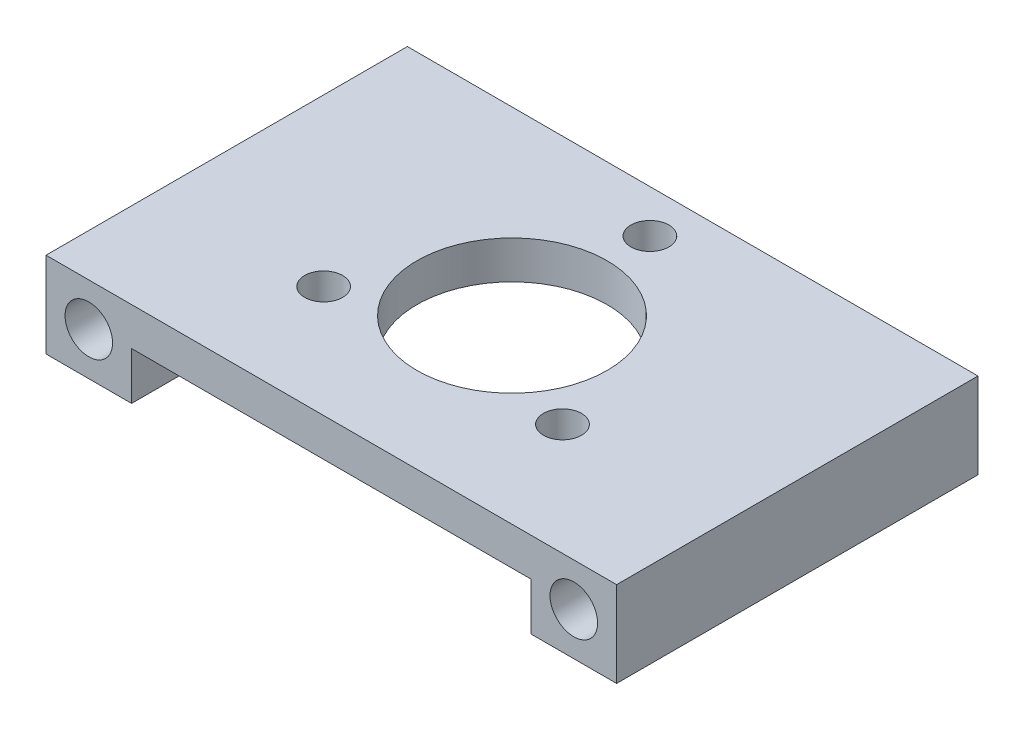
ISO-10303-21;
HEADER;
FILE_DESCRIPTION(('STEP AP214'),'2;1');
FILE_NAME('part.step','',(''),(''),'','','');
FILE_SCHEMA(('AUTOMOTIVE_DESIGN { 1 0 10303 214 1 1 1 1 }'));
ENDSEC;
DATA;
#1=APPLICATION_CONTEXT('core data for automotive mechanical design processes');
#2=APPLICATION_PROTOCOL_DEFINITION('international standard','automotive_design',2000,#1);
#3=PRODUCT_CONTEXT('',#1,'mechanical');
#4=PRODUCT('Part','Part','',(#3));
#5=PRODUCT_RELATED_PRODUCT_CATEGORY('part','',(#4));
#6=PRODUCT_DEFINITION_FORMATION('','',#4);
#7=PRODUCT_DEFINITION_CONTEXT('part definition',#1,'design');
#8=PRODUCT_DEFINITION('design','',#6,#7);
#9=PRODUCT_DEFINITION_SHAPE('','',#8);
#10=(LENGTH_UNIT() NAMED_UNIT(*) SI_UNIT(.MILLI.,.METRE.));
#11=(NAMED_UNIT(*) PLANE_ANGLE_UNIT() SI_UNIT($,.RADIAN.));
#12=(NAMED_UNIT(*) SI_UNIT($,.STERADIAN.) SOLID_ANGLE_UNIT());
#13=UNCERTAINTY_MEASURE_WITH_UNIT(LENGTH_MEASURE(1.E-05),#10,'distance_accuracy_value','');
#14=(GEOMETRIC_REPRESENTATION_CONTEXT(3) GLOBAL_UNCERTAINTY_ASSIGNED_CONTEXT((#13)) GLOBAL_UNIT_ASSIGNED_CONTEXT((#10,
#11,#12)) REPRESENTATION_CONTEXT('',''));
#15=CARTESIAN_POINT('',(0.,0.,0.));
#16=DIRECTION('',(0.,0.,1.));
#17=DIRECTION('',(1.,0.,0.));
#18=AXIS2_PLACEMENT_3D('',#15,#16,#17);
#19=CARTESIAN_POINT('',(0.,0.,-38.));
#20=DIRECTION('',(0.,0.,1.));
#21=DIRECTION('',(-1.,0.,0.));
#22=AXIS2_PLACEMENT_3D('',#19,#20,#21);
#23=PLANE('',#22);
#24=DIRECTION('',(-1.,0.,0.));
#25=VECTOR('',#24,1.);
#26=CARTESIAN_POINT('',(-30.,0.,-38.));
#27=LINE('',#26,#25);
#28=CARTESIAN_POINT('',(30.,0.,-38.));
#29=VERTEX_POINT('',#28);
#30=CARTESIAN_POINT('',(-30.,0.,-38.));
#31=VERTEX_POINT('',#30);
#32=EDGE_CURVE('E153',#29,#31,#27,.T.);
#33=ORIENTED_EDGE('',*,*,#32,.F.);
#34=DIRECTION('',(0.,1.,0.));
#35=VECTOR('',#34,1.);
#36=CARTESIAN_POINT('',(30.,0.,-38.));
#37=LINE('',#36,#35);
#38=CARTESIAN_POINT('',(30.,-9.,-38.));
#39=VERTEX_POINT('',#38);
#40=EDGE_CURVE('E127',#39,#29,#37,.T.);
#41=ORIENTED_EDGE('',*,*,#40,.F.);
#42=DIRECTION('',(1.,0.,0.));
#43=VECTOR('',#42,1.);
#44=CARTESIAN_POINT('',(30.,-9.,-38.));
#45=LINE('',#44,#43);
#46=CARTESIAN_POINT('',(21.,-9.,-38.));
#47=VERTEX_POINT('',#46);
#48=EDGE_CURVE('E108',#47,#39,#45,.T.);
#49=ORIENTED_EDGE('',*,*,#48,.F.);
#50=DIRECTION('',(0.,-1.,0.));
#51=VECTOR('',#50,1.);
#52=CARTESIAN_POINT('',(21.,-9.,-38.));
#53=LINE('',#52,#51);
#54=CARTESIAN_POINT('',(21.,-4.,-38.));
#55=VERTEX_POINT('',#54);
#56=EDGE_CURVE('E118',#55,#47,#53,.T.);
#57=ORIENTED_EDGE('',*,*,#56,.F.);
#58=DIRECTION('',(1.,0.,0.));
#59=VECTOR('',#58,1.);
#60=CARTESIAN_POINT('',(-21.,-4.,-38.));
#61=LINE('',#60,#59);
#62=CARTESIAN_POINT('',(-21.,-4.,-38.));
#63=VERTEX_POINT('',#62);
#64=EDGE_CURVE('E123',#63,#55,#61,.T.);
#65=ORIENTED_EDGE('',*,*,#64,.F.);
#66=DIRECTION('',(0.,1.,0.));
#67=VECTOR('',#66,1.);
#68=CARTESIAN_POINT('',(-21.,-9.00000000000001,-38.));
#69=LINE('',#68,#67);
#70=CARTESIAN_POINT('',(-21.,-9.00000000000001,-38.));
#71=VERTEX_POINT('',#70);
#72=EDGE_CURVE('E179',#71,#63,#69,.T.);
#73=ORIENTED_EDGE('',*,*,#72,.F.);
#74=DIRECTION('',(1.,0.,0.));
#75=VECTOR('',#74,1.);
#76=CARTESIAN_POINT('',(-30.,-9.00000000000001,-38.));
#77=LINE('',#76,#75);
#78=CARTESIAN_POINT('',(-30.,-9.00000000000001,-38.));
#79=VERTEX_POINT('',#78);
#80=EDGE_CURVE('E172',#79,#71,#77,.T.);
#81=ORIENTED_EDGE('',*,*,#80,.F.);
#82=DIRECTION('',(0.,-1.,0.));
#83=VECTOR('',#82,1.);
#84=CARTESIAN_POINT('',(-30.,0.,-38.));
#85=LINE('',#84,#83);
#86=EDGE_CURVE('E162',#31,#79,#85,.T.);
#87=ORIENTED_EDGE('',*,*,#86,.F.);
#88=EDGE_LOOP('',(#33,#41,#49,#57,#65,#73,#81,#87));
#89=FACE_BOUND('',#88,.T.);
#90=CARTESIAN_POINT('',(25.5,-4.5,-38.));
#91=DIRECTION('',(0.,0.,1.));
#92=DIRECTION('',(-1.,0.,0.));
#93=AXIS2_PLACEMENT_3D('',#90,#91,#92);
#94=CIRCLE('',#93,2.5);
#95=CARTESIAN_POINT('',(23.,-4.5,-38.));
#96=VERTEX_POINT('',#95);
#97=EDGE_CURVE('E136',#96,#96,#94,.T.);
#98=ORIENTED_EDGE('',*,*,#97,.T.);
#99=EDGE_LOOP('',(#98));
#100=FACE_BOUND('',#99,.T.);
#101=CARTESIAN_POINT('',(-25.5,-4.5,-38.));
#102=DIRECTION('',(0.,0.,1.));
#103=DIRECTION('',(1.,0.,0.));
#104=AXIS2_PLACEMENT_3D('',#101,#102,#103);
#105=CIRCLE('',#104,2.5);
#106=CARTESIAN_POINT('',(-23.,-4.5,-38.));
#107=VERTEX_POINT('',#106);
#108=EDGE_CURVE('E356',#107,#107,#105,.T.);
#109=ORIENTED_EDGE('',*,*,#108,.T.);
#110=EDGE_LOOP('',(#109));
#111=FACE_BOUND('',#110,.T.);
#112=ADVANCED_FACE('F35',(#89,#100,#111),#23,.F.);
#113=CARTESIAN_POINT('',(0.,0.,0.));
#114=DIRECTION('',(0.,0.,1.));
#115=DIRECTION('',(-1.,0.,0.));
#116=AXIS2_PLACEMENT_3D('',#113,#114,#115);
#117=PLANE('',#116);
#118=CARTESIAN_POINT('',(25.5,-4.5,0.));
#119=DIRECTION('',(0.,0.,1.));
#120=DIRECTION('',(-1.,0.,0.));
#121=AXIS2_PLACEMENT_3D('',#118,#119,#120);
#122=CIRCLE('',#121,2.5);
#123=CARTESIAN_POINT('',(23.,-4.5,0.));
#124=VERTEX_POINT('',#123);
#125=EDGE_CURVE('E175',#124,#124,#122,.T.);
#126=ORIENTED_EDGE('',*,*,#125,.F.);
#127=EDGE_LOOP('',(#126));
#128=FACE_BOUND('',#127,.T.);
#129=DIRECTION('',(-1.,0.,0.));
#130=VECTOR('',#129,1.);
#131=CARTESIAN_POINT('',(-30.,0.,0.));
#132=LINE('',#131,#130);
#133=CARTESIAN_POINT('',(30.,0.,0.));
#134=VERTEX_POINT('',#133);
#135=CARTESIAN_POINT('',(-30.,0.,0.));
#136=VERTEX_POINT('',#135);
#137=EDGE_CURVE('E132',#134,#136,#132,.T.);
#138=ORIENTED_EDGE('',*,*,#137,.T.);
#139=DIRECTION('',(0.,-1.,0.));
#140=VECTOR('',#139,1.);
#141=CARTESIAN_POINT('',(-30.,0.,0.));
#142=LINE('',#141,#140);
#143=CARTESIAN_POINT('',(-30.,-9.00000000000001,0.));
#144=VERTEX_POINT('',#143);
#145=EDGE_CURVE('E135',#136,#144,#142,.T.);
#146=ORIENTED_EDGE('',*,*,#145,.T.);
#147=DIRECTION('',(1.,0.,0.));
#148=VECTOR('',#147,1.);
#149=CARTESIAN_POINT('',(-30.,-9.00000000000001,0.));
#150=LINE('',#149,#148);
#151=CARTESIAN_POINT('',(-21.,-9.00000000000001,0.));
#152=VERTEX_POINT('',#151);
#153=EDGE_CURVE('E139',#144,#152,#150,.T.);
#154=ORIENTED_EDGE('',*,*,#153,.T.);
#155=DIRECTION('',(0.,1.,0.));
#156=VECTOR('',#155,1.);
#157=CARTESIAN_POINT('',(-21.,-9.00000000000001,0.));
#158=LINE('',#157,#156);
#159=CARTESIAN_POINT('',(-21.,-4.,0.));
#160=VERTEX_POINT('',#159);
#161=EDGE_CURVE('E142',#152,#160,#158,.T.);
#162=ORIENTED_EDGE('',*,*,#161,.T.);
#163=DIRECTION('',(1.,0.,0.));
#164=VECTOR('',#163,1.);
#165=CARTESIAN_POINT('',(-21.,-4.,0.));
#166=LINE('',#165,#164);
#167=CARTESIAN_POINT('',(21.,-4.,0.));
#168=VERTEX_POINT('',#167);
#169=EDGE_CURVE('E145',#160,#168,#166,.T.);
#170=ORIENTED_EDGE('',*,*,#169,.T.);
#171=DIRECTION('',(0.,-1.,0.));
#172=VECTOR('',#171,1.);
#173=CARTESIAN_POINT('',(21.,-9.,0.));
#174=LINE('',#173,#172);
#175=CARTESIAN_POINT('',(21.,-9.,0.));
#176=VERTEX_POINT('',#175);
#177=EDGE_CURVE('E148',#168,#176,#174,.T.);
#178=ORIENTED_EDGE('',*,*,#177,.T.);
#179=DIRECTION('',(1.,0.,0.));
#180=VECTOR('',#179,1.);
#181=CARTESIAN_POINT('',(30.,-9.,0.));
#182=LINE('',#181,#180);
#183=CARTESIAN_POINT('',(30.,-9.,0.));
#184=VERTEX_POINT('',#183);
#185=EDGE_CURVE('E111',#176,#184,#182,.T.);
#186=ORIENTED_EDGE('',*,*,#185,.T.);
#187=DIRECTION('',(0.,1.,0.));
#188=VECTOR('',#187,1.);
#189=CARTESIAN_POINT('',(30.,0.,0.));
#190=LINE('',#189,#188);
#191=EDGE_CURVE('E151',#184,#134,#190,.T.);
#192=ORIENTED_EDGE('',*,*,#191,.T.);
#193=EDGE_LOOP('',(#138,#146,#154,#162,#170,#178,#186,#192));
#194=FACE_BOUND('',#193,.T.);
#195=CARTESIAN_POINT('',(-25.5,-4.5,0.));
#196=DIRECTION('',(0.,0.,1.));
#197=DIRECTION('',(1.,0.,0.));
#198=AXIS2_PLACEMENT_3D('',#195,#196,#197);
#199=CIRCLE('',#198,2.5);
#200=CARTESIAN_POINT('',(-23.,-4.5,0.));
#201=VERTEX_POINT('',#200);
#202=EDGE_CURVE('E355',#201,#201,#199,.T.);
#203=ORIENTED_EDGE('',*,*,#202,.F.);
#204=EDGE_LOOP('',(#203));
#205=FACE_BOUND('',#204,.T.);
#206=ADVANCED_FACE('F169',(#128,#194,#205),#117,.T.);
#207=CARTESIAN_POINT('',(-30.,0.,-38.));
#208=DIRECTION('',(0.,-1.,0.));
#209=DIRECTION('',(1.,0.,0.));
#210=AXIS2_PLACEMENT_3D('',#207,#208,#209);
#211=PLANE('',#210);
#212=CARTESIAN_POINT('',(-12.5573683548735,0.,-11.7499999999996));
#213=DIRECTION('',(0.,1.,0.));
#214=DIRECTION('',(1.,0.,0.));
#215=AXIS2_PLACEMENT_3D('',#212,#213,#214);
#216=CIRCLE('',#215,2.);
#217=CARTESIAN_POINT('',(-10.5573683548735,0.,-11.7499999999996));
#218=VERTEX_POINT('',#217);
#219=EDGE_CURVE('E332',#218,#218,#216,.T.);
#220=ORIENTED_EDGE('',*,*,#219,.F.);
#221=EDGE_LOOP('',(#220));
#222=FACE_BOUND('',#221,.T.);
#223=CARTESIAN_POINT('',(12.5573683548752,0.,-11.7500000000005));
#224=DIRECTION('',(0.,1.,0.));
#225=DIRECTION('',(1.,0.,0.));
#226=AXIS2_PLACEMENT_3D('',#223,#224,#225);
#227=CIRCLE('',#226,2.);
#228=CARTESIAN_POINT('',(14.5573683548752,0.,-11.7500000000005));
#229=VERTEX_POINT('',#228);
#230=EDGE_CURVE('E336',#229,#229,#227,.T.);
#231=ORIENTED_EDGE('',*,*,#230,.F.);
#232=EDGE_LOOP('',(#231));
#233=FACE_BOUND('',#232,.T.);
#234=CARTESIAN_POINT('',(0.,0.,-33.5));
#235=DIRECTION('',(0.,1.,0.));
#236=DIRECTION('',(1.,0.,0.));
#237=AXIS2_PLACEMENT_3D('',#234,#235,#236);
#238=CIRCLE('',#237,2.);
#239=CARTESIAN_POINT('',(2.,0.,-33.5));
#240=VERTEX_POINT('',#239);
#241=EDGE_CURVE('E340',#240,#240,#238,.T.);
#242=ORIENTED_EDGE('',*,*,#241,.F.);
#243=EDGE_LOOP('',(#242));
#244=FACE_BOUND('',#243,.T.);
#245=CARTESIAN_POINT('',(0.,0.,-19.));
#246=DIRECTION('',(0.,1.,0.));
#247=DIRECTION('',(1.,0.,0.));
#248=AXIS2_PLACEMENT_3D('',#245,#246,#247);
#249=CIRCLE('',#248,10.);
#250=CARTESIAN_POINT('',(10.,0.,-19.));
#251=VERTEX_POINT('',#250);
#252=EDGE_CURVE('E343',#251,#251,#249,.T.);
#253=ORIENTED_EDGE('',*,*,#252,.F.);
#254=EDGE_LOOP('',(#253));
#255=FACE_BOUND('',#254,.T.);
#256=ORIENTED_EDGE('',*,*,#137,.F.);
#257=DIRECTION('',(0.,0.,1.));
#258=VECTOR('',#257,1.);
#259=CARTESIAN_POINT('',(30.,0.,-38.));
#260=LINE('',#259,#258);
#261=EDGE_CURVE('E52',#29,#134,#260,.T.);
#262=ORIENTED_EDGE('',*,*,#261,.F.);
#263=ORIENTED_EDGE('',*,*,#32,.T.);
#264=DIRECTION('',(0.,0.,1.));
#265=VECTOR('',#264,1.);
#266=CARTESIAN_POINT('',(-30.,0.,-38.));
#267=LINE('',#266,#265);
#268=EDGE_CURVE('E11',#31,#136,#267,.T.);
#269=ORIENTED_EDGE('',*,*,#268,.T.);
#270=EDGE_LOOP('',(#256,#262,#263,#269));
#271=FACE_BOUND('',#270,.T.);
#272=ADVANCED_FACE('F37',(#222,#233,#244,#255,#271),#211,.F.);
#273=CARTESIAN_POINT('',(-30.,0.,-38.));
#274=DIRECTION('',(1.,0.,0.));
#275=DIRECTION('',(0.,0.,1.));
#276=AXIS2_PLACEMENT_3D('',#273,#274,#275);
#277=PLANE('',#276);
#278=ORIENTED_EDGE('',*,*,#145,.F.);
#279=ORIENTED_EDGE('',*,*,#268,.F.);
#280=ORIENTED_EDGE('',*,*,#86,.T.);
#281=DIRECTION('',(0.,0.,1.));
#282=VECTOR('',#281,1.);
#283=CARTESIAN_POINT('',(-30.,-9.00000000000001,-38.));
#284=LINE('',#283,#282);
#285=EDGE_CURVE('E44',#79,#144,#284,.T.);
#286=ORIENTED_EDGE('',*,*,#285,.T.);
#287=EDGE_LOOP('',(#278,#279,#280,#286));
#288=FACE_BOUND('',#287,.T.);
#289=ADVANCED_FACE('F161',(#288),#277,.F.);
#290=CARTESIAN_POINT('',(-30.,-9.00000000000001,-38.));
#291=DIRECTION('',(0.,1.,0.));
#292=DIRECTION('',(0.,0.,-1.));
#293=AXIS2_PLACEMENT_3D('',#290,#291,#292);
#294=PLANE('',#293);
#295=ORIENTED_EDGE('',*,*,#153,.F.);
#296=ORIENTED_EDGE('',*,*,#285,.F.);
#297=ORIENTED_EDGE('',*,*,#80,.T.);
#298=DIRECTION('',(0.,0.,1.));
#299=VECTOR('',#298,1.);
#300=CARTESIAN_POINT('',(-21.,-9.00000000000001,-38.));
#301=LINE('',#300,#299);
#302=EDGE_CURVE('E159',#71,#152,#301,.T.);
#303=ORIENTED_EDGE('',*,*,#302,.T.);
#304=EDGE_LOOP('',(#295,#296,#297,#303));
#305=FACE_BOUND('',#304,.T.);
#306=ADVANCED_FACE('F166',(#305),#294,.F.);
#307=CARTESIAN_POINT('',(-21.,-9.00000000000001,-38.));
#308=DIRECTION('',(-1.,0.,0.));
#309=DIRECTION('',(0.,0.,-1.));
#310=AXIS2_PLACEMENT_3D('',#307,#308,#309);
#311=PLANE('',#310);
#312=ORIENTED_EDGE('',*,*,#161,.F.);
#313=ORIENTED_EDGE('',*,*,#302,.F.);
#314=ORIENTED_EDGE('',*,*,#72,.T.);
#315=DIRECTION('',(0.,0.,1.));
#316=VECTOR('',#315,1.);
#317=CARTESIAN_POINT('',(-21.,-4.,-38.));
#318=LINE('',#317,#316);
#319=EDGE_CURVE('E157',#63,#160,#318,.T.);
#320=ORIENTED_EDGE('',*,*,#319,.T.);
#321=EDGE_LOOP('',(#312,#313,#314,#320));
#322=FACE_BOUND('',#321,.T.);
#323=ADVANCED_FACE('F186',(#322),#311,.F.);
#324=CARTESIAN_POINT('',(-21.,-4.,-38.));
#325=DIRECTION('',(0.,1.,0.));
#326=DIRECTION('',(0.,0.,-1.));
#327=AXIS2_PLACEMENT_3D('',#324,#325,#326);
#328=PLANE('',#327);
#329=CARTESIAN_POINT('',(-12.5573683548735,-4.,-11.7499999999996));
#330=DIRECTION('',(0.,1.,0.));
#331=DIRECTION('',(1.,0.,0.));
#332=AXIS2_PLACEMENT_3D('',#329,#330,#331);
#333=CIRCLE('',#332,2.);
#334=CARTESIAN_POINT('',(-10.5573683548735,-4.,-11.7499999999996));
#335=VERTEX_POINT('',#334);
#336=EDGE_CURVE('E371',#335,#335,#333,.T.);
#337=ORIENTED_EDGE('',*,*,#336,.T.);
#338=EDGE_LOOP('',(#337));
#339=FACE_BOUND('',#338,.T.);
#340=CARTESIAN_POINT('',(12.5573683548752,-4.,-11.7500000000005));
#341=DIRECTION('',(0.,1.,0.));
#342=DIRECTION('',(1.,0.,0.));
#343=AXIS2_PLACEMENT_3D('',#340,#341,#342);
#344=CIRCLE('',#343,2.);
#345=CARTESIAN_POINT('',(14.5573683548752,-4.,-11.7500000000005));
#346=VERTEX_POINT('',#345);
#347=EDGE_CURVE('E374',#346,#346,#344,.T.);
#348=ORIENTED_EDGE('',*,*,#347,.T.);
#349=EDGE_LOOP('',(#348));
#350=FACE_BOUND('',#349,.T.);
#351=CARTESIAN_POINT('',(0.,-4.,-33.5));
#352=DIRECTION('',(0.,1.,0.));
#353=DIRECTION('',(1.,0.,0.));
#354=AXIS2_PLACEMENT_3D('',#351,#352,#353);
#355=CIRCLE('',#354,2.);
#356=CARTESIAN_POINT('',(2.,-4.,-33.5));
#357=VERTEX_POINT('',#356);
#358=EDGE_CURVE('E349',#357,#357,#355,.T.);
#359=ORIENTED_EDGE('',*,*,#358,.T.);
#360=EDGE_LOOP('',(#359));
#361=FACE_BOUND('',#360,.T.);
#362=CARTESIAN_POINT('',(0.,-4.,-19.));
#363=DIRECTION('',(0.,1.,0.));
#364=DIRECTION('',(1.,0.,0.));
#365=AXIS2_PLACEMENT_3D('',#362,#363,#364);
#366=CIRCLE('',#365,10.);
#367=CARTESIAN_POINT('',(10.,-4.,-19.));
#368=VERTEX_POINT('',#367);
#369=EDGE_CURVE('E345',#368,#368,#366,.T.);
#370=ORIENTED_EDGE('',*,*,#369,.T.);
#371=EDGE_LOOP('',(#370));
#372=FACE_BOUND('',#371,.T.);
#373=ORIENTED_EDGE('',*,*,#169,.F.);
#374=ORIENTED_EDGE('',*,*,#319,.F.);
#375=ORIENTED_EDGE('',*,*,#64,.T.);
#376=DIRECTION('',(0.,0.,1.));
#377=VECTOR('',#376,1.);
#378=CARTESIAN_POINT('',(21.,-4.,-38.));
#379=LINE('',#378,#377);
#380=EDGE_CURVE('E115',#55,#168,#379,.T.);
#381=ORIENTED_EDGE('',*,*,#380,.T.);
#382=EDGE_LOOP('',(#373,#374,#375,#381));
#383=FACE_BOUND('',#382,.T.);
#384=ADVANCED_FACE('F183',(#339,#350,#361,#372,#383),#328,.F.);
#385=CARTESIAN_POINT('',(21.,-9.,-38.));
#386=DIRECTION('',(1.,0.,0.));
#387=DIRECTION('',(0.,1.,0.));
#388=AXIS2_PLACEMENT_3D('',#385,#386,#387);
#389=PLANE('',#388);
#390=ORIENTED_EDGE('',*,*,#177,.F.);
#391=ORIENTED_EDGE('',*,*,#380,.F.);
#392=ORIENTED_EDGE('',*,*,#56,.T.);
#393=DIRECTION('',(0.,0.,1.));
#394=VECTOR('',#393,1.);
#395=CARTESIAN_POINT('',(21.,-9.,-38.));
#396=LINE('',#395,#394);
#397=EDGE_CURVE('E104',#47,#176,#396,.T.);
#398=ORIENTED_EDGE('',*,*,#397,.T.);
#399=EDGE_LOOP('',(#390,#391,#392,#398));
#400=FACE_BOUND('',#399,.T.);
#401=ADVANCED_FACE('F119',(#400),#389,.F.);
#402=CARTESIAN_POINT('',(30.,-9.,-38.));
#403=DIRECTION('',(0.,1.,0.));
#404=DIRECTION('',(0.,0.,-1.));
#405=AXIS2_PLACEMENT_3D('',#402,#403,#404);
#406=PLANE('',#405);
#407=ORIENTED_EDGE('',*,*,#185,.F.);
#408=ORIENTED_EDGE('',*,*,#397,.F.);
#409=ORIENTED_EDGE('',*,*,#48,.T.);
#410=DIRECTION('',(0.,0.,1.));
#411=VECTOR('',#410,1.);
#412=CARTESIAN_POINT('',(30.,-9.,-38.));
#413=LINE('',#412,#411);
#414=EDGE_CURVE('E80',#39,#184,#413,.T.);
#415=ORIENTED_EDGE('',*,*,#414,.T.);
#416=EDGE_LOOP('',(#407,#408,#409,#415));
#417=FACE_BOUND('',#416,.T.);
#418=ADVANCED_FACE('F106',(#417),#406,.F.);
#419=CARTESIAN_POINT('',(30.,0.,-38.));
#420=DIRECTION('',(-1.,0.,0.));
#421=DIRECTION('',(0.,0.,-1.));
#422=AXIS2_PLACEMENT_3D('',#419,#420,#421);
#423=PLANE('',#422);
#424=ORIENTED_EDGE('',*,*,#191,.F.);
#425=ORIENTED_EDGE('',*,*,#414,.F.);
#426=ORIENTED_EDGE('',*,*,#40,.T.);
#427=ORIENTED_EDGE('',*,*,#261,.T.);
#428=EDGE_LOOP('',(#424,#425,#426,#427));
#429=FACE_BOUND('',#428,.T.);
#430=ADVANCED_FACE('F207',(#429),#423,.F.);
#431=CARTESIAN_POINT('',(25.5,-4.5,-38.));
#432=DIRECTION('',(0.,0.,1.));
#433=DIRECTION('',(-1.,0.,0.));
#434=AXIS2_PLACEMENT_3D('',#431,#432,#433);
#435=CYLINDRICAL_SURFACE('',#434,2.5);
#436=ORIENTED_EDGE('',*,*,#97,.F.);
#437=EDGE_LOOP('',(#436));
#438=FACE_BOUND('',#437,.T.);
#439=ORIENTED_EDGE('',*,*,#125,.T.);
#440=EDGE_LOOP('',(#439));
#441=FACE_BOUND('',#440,.T.);
#442=ADVANCED_FACE('F204',(#438,#441),#435,.F.);
#443=CARTESIAN_POINT('',(-25.5,-4.5,-38.));
#444=DIRECTION('',(0.,0.,1.));
#445=DIRECTION('',(-1.,0.,0.));
#446=AXIS2_PLACEMENT_3D('',#443,#444,#445);
#447=CYLINDRICAL_SURFACE('',#446,2.5);
#448=ORIENTED_EDGE('',*,*,#108,.F.);
#449=EDGE_LOOP('',(#448));
#450=FACE_BOUND('',#449,.T.);
#451=ORIENTED_EDGE('',*,*,#202,.T.);
#452=EDGE_LOOP('',(#451));
#453=FACE_BOUND('',#452,.T.);
#454=ADVANCED_FACE('F231',(#450,#453),#447,.F.);
#455=CARTESIAN_POINT('',(0.,34.,-19.));
#456=DIRECTION('',(0.,-1.,0.));
#457=DIRECTION('',(1.,0.,0.));
#458=AXIS2_PLACEMENT_3D('',#455,#456,#457);
#459=CYLINDRICAL_SURFACE('',#458,10.);
#460=ORIENTED_EDGE('',*,*,#369,.F.);
#461=EDGE_LOOP('',(#460));
#462=FACE_BOUND('',#461,.T.);
#463=ORIENTED_EDGE('',*,*,#252,.T.);
#464=EDGE_LOOP('',(#463));
#465=FACE_BOUND('',#464,.T.);
#466=ADVANCED_FACE('F238',(#462,#465),#459,.F.);
#467=CARTESIAN_POINT('',(0.,34.,-33.5));
#468=DIRECTION('',(0.,-1.,0.));
#469=DIRECTION('',(1.,0.,0.));
#470=AXIS2_PLACEMENT_3D('',#467,#468,#469);
#471=CYLINDRICAL_SURFACE('',#470,2.);
#472=ORIENTED_EDGE('',*,*,#358,.F.);
#473=EDGE_LOOP('',(#472));
#474=FACE_BOUND('',#473,.T.);
#475=ORIENTED_EDGE('',*,*,#241,.T.);
#476=EDGE_LOOP('',(#475));
#477=FACE_BOUND('',#476,.T.);
#478=ADVANCED_FACE('F245',(#474,#477),#471,.F.);
#479=CARTESIAN_POINT('',(12.5573683548753,34.,-11.7500000000005));
#480=DIRECTION('',(0.,-1.,0.));
#481=DIRECTION('',(1.,0.,0.));
#482=AXIS2_PLACEMENT_3D('',#479,#480,#481);
#483=CYLINDRICAL_SURFACE('',#482,2.);
#484=ORIENTED_EDGE('',*,*,#347,.F.);
#485=EDGE_LOOP('',(#484));
#486=FACE_BOUND('',#485,.T.);
#487=ORIENTED_EDGE('',*,*,#230,.T.);
#488=EDGE_LOOP('',(#487));
#489=FACE_BOUND('',#488,.T.);
#490=ADVANCED_FACE('F253',(#486,#489),#483,.F.);
#491=CARTESIAN_POINT('',(-12.5573683548735,34.,-11.7499999999996));
#492=DIRECTION('',(0.,-1.,0.));
#493=DIRECTION('',(1.,0.,0.));
#494=AXIS2_PLACEMENT_3D('',#491,#492,#493);
#495=CYLINDRICAL_SURFACE('',#494,2.);
#496=ORIENTED_EDGE('',*,*,#336,.F.);
#497=EDGE_LOOP('',(#496));
#498=FACE_BOUND('',#497,.T.);
#499=ORIENTED_EDGE('',*,*,#219,.T.);
#500=EDGE_LOOP('',(#499));
#501=FACE_BOUND('',#500,.T.);
#502=ADVANCED_FACE('F261',(#498,#501),#495,.F.);
#503=CLOSED_SHELL('',(#112,#206,#272,#289,#306,#323,#384,#401,#418,#430,#442,#454,#466,#478,
#490,#502));
#504=MANIFOLD_SOLID_BREP('B2',#503);
#505=ADVANCED_BREP_SHAPE_REPRESENTATION('',(#18,#504),#14);
#506=SHAPE_DEFINITION_REPRESENTATION(#9,#505);
ENDSEC;
END-ISO-10303-21;
